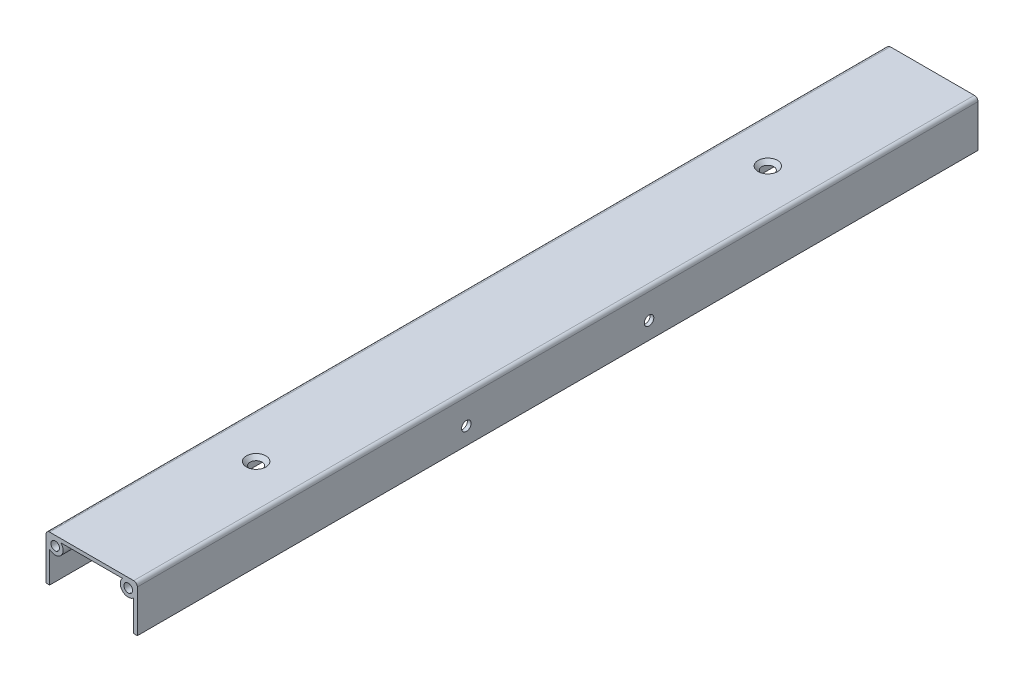
ISO-10303-21;
HEADER;
FILE_DESCRIPTION(('STEP AP214'),'2;1');
FILE_NAME('part.step','',(''),(''),'','','');
FILE_SCHEMA(('AUTOMOTIVE_DESIGN { 1 0 10303 214 1 1 1 1 }'));
ENDSEC;
DATA;
#1=APPLICATION_CONTEXT('core data for automotive mechanical design processes');
#2=APPLICATION_PROTOCOL_DEFINITION('international standard','automotive_design',2000,#1);
#3=PRODUCT_CONTEXT('',#1,'mechanical');
#4=PRODUCT('Part','Part','',(#3));
#5=PRODUCT_RELATED_PRODUCT_CATEGORY('part','',(#4));
#6=PRODUCT_DEFINITION_FORMATION('','',#4);
#7=PRODUCT_DEFINITION_CONTEXT('part definition',#1,'design');
#8=PRODUCT_DEFINITION('design','',#6,#7);
#9=PRODUCT_DEFINITION_SHAPE('','',#8);
#10=(LENGTH_UNIT() NAMED_UNIT(*) SI_UNIT(.MILLI.,.METRE.));
#11=(NAMED_UNIT(*) PLANE_ANGLE_UNIT() SI_UNIT($,.RADIAN.));
#12=(NAMED_UNIT(*) SI_UNIT($,.STERADIAN.) SOLID_ANGLE_UNIT());
#13=UNCERTAINTY_MEASURE_WITH_UNIT(LENGTH_MEASURE(1.E-05),#10,'distance_accuracy_value','');
#14=(GEOMETRIC_REPRESENTATION_CONTEXT(3) GLOBAL_UNCERTAINTY_ASSIGNED_CONTEXT((#13)) GLOBAL_UNIT_ASSIGNED_CONTEXT((#10,
#11,#12)) REPRESENTATION_CONTEXT('',''));
#15=CARTESIAN_POINT('',(0.,0.,0.));
#16=DIRECTION('',(0.,0.,1.));
#17=DIRECTION('',(1.,0.,0.));
#18=AXIS2_PLACEMENT_3D('',#15,#16,#17);
#19=CARTESIAN_POINT('',(0.,0.,292.1));
#20=DIRECTION('',(0.,0.,-1.));
#21=DIRECTION('',(-1.,0.,0.));
#22=AXIS2_PLACEMENT_3D('',#19,#20,#21);
#23=PLANE('',#22);
#24=DIRECTION('',(0.,-1.,0.));
#25=VECTOR('',#24,1.);
#26=CARTESIAN_POINT('',(-31.75,-31.75,292.1));
#27=LINE('',#26,#25);
#28=CARTESIAN_POINT('',(-31.75,29.21,292.1));
#29=VERTEX_POINT('',#28);
#30=CARTESIAN_POINT('',(-31.75,-0.128852466554086,292.1));
#31=VERTEX_POINT('',#30);
#32=EDGE_CURVE('E160',#29,#31,#27,.T.);
#33=ORIENTED_EDGE('',*,*,#32,.T.);
#34=DIRECTION('',(-1.,0.,0.));
#35=VECTOR('',#34,1.);
#36=CARTESIAN_POINT('',(-31.75,-0.128852466554086,292.1));
#37=LINE('',#36,#35);
#38=CARTESIAN_POINT('',(-29.21,-0.128852466554086,292.1));
#39=VERTEX_POINT('',#38);
#40=EDGE_CURVE('E124',#39,#31,#37,.T.);
#41=ORIENTED_EDGE('',*,*,#40,.F.);
#42=DIRECTION('',(0.,-1.,0.));
#43=VECTOR('',#42,1.);
#44=CARTESIAN_POINT('',(-29.21,0.,292.1));
#45=LINE('',#44,#43);
#46=CARTESIAN_POINT('',(-29.21,21.3781223290607,292.1));
#47=VERTEX_POINT('',#46);
#48=EDGE_CURVE('E220',#47,#39,#45,.T.);
#49=ORIENTED_EDGE('',*,*,#48,.F.);
#50=CARTESIAN_POINT('',(-25.4,25.4,292.1));
#51=DIRECTION('',(0.,0.,-1.));
#52=DIRECTION('',(-1.,0.,0.));
#53=AXIS2_PLACEMENT_3D('',#50,#51,#52);
#54=CIRCLE('',#53,5.53999999999999);
#55=CARTESIAN_POINT('',(-21.3781223290607,29.21,292.1));
#56=VERTEX_POINT('',#55);
#57=EDGE_CURVE('E223',#47,#56,#54,.F.);
#58=ORIENTED_EDGE('',*,*,#57,.T.);
#59=DIRECTION('',(-1.,0.,0.));
#60=VECTOR('',#59,1.);
#61=CARTESIAN_POINT('',(0.,29.21,292.1));
#62=LINE('',#61,#60);
#63=CARTESIAN_POINT('',(21.3781223290607,29.21,292.1));
#64=VERTEX_POINT('',#63);
#65=EDGE_CURVE('E241',#64,#56,#62,.T.);
#66=ORIENTED_EDGE('',*,*,#65,.F.);
#67=CARTESIAN_POINT('',(25.4,25.4,292.1));
#68=DIRECTION('',(0.,0.,-1.));
#69=DIRECTION('',(-1.,0.,0.));
#70=AXIS2_PLACEMENT_3D('',#67,#68,#69);
#71=CIRCLE('',#70,5.53999999999999);
#72=CARTESIAN_POINT('',(29.21,21.3781223290607,292.1));
#73=VERTEX_POINT('',#72);
#74=EDGE_CURVE('E224',#64,#73,#71,.F.);
#75=ORIENTED_EDGE('',*,*,#74,.T.);
#76=DIRECTION('',(0.,1.,0.));
#77=VECTOR('',#76,1.);
#78=CARTESIAN_POINT('',(29.21,0.,292.1));
#79=LINE('',#78,#77);
#80=CARTESIAN_POINT('',(29.21,-0.128852466554086,292.1));
#81=VERTEX_POINT('',#80);
#82=EDGE_CURVE('E237',#81,#73,#79,.T.);
#83=ORIENTED_EDGE('',*,*,#82,.F.);
#84=CARTESIAN_POINT('',(31.75,-0.128852466554086,292.1));
#85=VERTEX_POINT('',#84);
#86=EDGE_CURVE('E50',#85,#81,#37,.T.);
#87=ORIENTED_EDGE('',*,*,#86,.F.);
#88=DIRECTION('',(0.,1.,0.));
#89=VECTOR('',#88,1.);
#90=CARTESIAN_POINT('',(31.75,-31.75,292.1));
#91=LINE('',#90,#89);
#92=CARTESIAN_POINT('',(31.75,29.21,292.1));
#93=VERTEX_POINT('',#92);
#94=EDGE_CURVE('E146',#85,#93,#91,.T.);
#95=ORIENTED_EDGE('',*,*,#94,.T.);
#96=CARTESIAN_POINT('',(29.21,29.21,292.1));
#97=DIRECTION('',(0.,0.,-1.));
#98=DIRECTION('',(-1.,0.,0.));
#99=AXIS2_PLACEMENT_3D('',#96,#97,#98);
#100=CIRCLE('',#99,2.54);
#101=CARTESIAN_POINT('',(29.21,31.75,292.1));
#102=VERTEX_POINT('',#101);
#103=EDGE_CURVE('E163',#93,#102,#100,.F.);
#104=ORIENTED_EDGE('',*,*,#103,.T.);
#105=DIRECTION('',(-1.,0.,0.));
#106=VECTOR('',#105,1.);
#107=CARTESIAN_POINT('',(-31.75,31.75,292.1));
#108=LINE('',#107,#106);
#109=CARTESIAN_POINT('',(-29.21,31.75,292.1));
#110=VERTEX_POINT('',#109);
#111=EDGE_CURVE('E149',#102,#110,#108,.T.);
#112=ORIENTED_EDGE('',*,*,#111,.T.);
#113=CARTESIAN_POINT('',(-29.21,29.21,292.1));
#114=DIRECTION('',(0.,0.,-1.));
#115=DIRECTION('',(-1.,0.,0.));
#116=AXIS2_PLACEMENT_3D('',#113,#114,#115);
#117=CIRCLE('',#116,2.54);
#118=EDGE_CURVE('E165',#110,#29,#117,.F.);
#119=ORIENTED_EDGE('',*,*,#118,.T.);
#120=EDGE_LOOP('',(#33,#41,#49,#58,#66,#75,#83,#87,#95,#104,#112,#119));
#121=FACE_BOUND('',#120,.T.);
#122=CARTESIAN_POINT('',(-25.4,25.4,292.1));
#123=DIRECTION('',(0.,0.,1.));
#124=DIRECTION('',(1.,0.,0.));
#125=AXIS2_PLACEMENT_3D('',#122,#123,#124);
#126=CIRCLE('',#125,2.99999999999999);
#127=CARTESIAN_POINT('',(-22.4,25.4,292.1));
#128=VERTEX_POINT('',#127);
#129=EDGE_CURVE('E196',#128,#128,#126,.T.);
#130=ORIENTED_EDGE('',*,*,#129,.F.);
#131=EDGE_LOOP('',(#130));
#132=FACE_BOUND('',#131,.T.);
#133=CARTESIAN_POINT('',(25.4,25.4,292.1));
#134=DIRECTION('',(0.,0.,1.));
#135=DIRECTION('',(-1.,0.,0.));
#136=AXIS2_PLACEMENT_3D('',#133,#134,#135);
#137=CIRCLE('',#136,2.99999999999999);
#138=CARTESIAN_POINT('',(22.4,25.4,292.1));
#139=VERTEX_POINT('',#138);
#140=EDGE_CURVE('E203',#139,#139,#137,.T.);
#141=ORIENTED_EDGE('',*,*,#140,.F.);
#142=EDGE_LOOP('',(#141));
#143=FACE_BOUND('',#142,.T.);
#144=ADVANCED_FACE('F34',(#121,#132,#143),#23,.F.);
#145=CARTESIAN_POINT('',(0.,0.,-292.1));
#146=DIRECTION('',(0.,0.,-1.));
#147=DIRECTION('',(-1.,0.,0.));
#148=AXIS2_PLACEMENT_3D('',#145,#146,#147);
#149=PLANE('',#148);
#150=DIRECTION('',(-1.,0.,0.));
#151=VECTOR('',#150,1.);
#152=CARTESIAN_POINT('',(-31.75,-0.128852466554086,-292.1));
#153=LINE('',#152,#151);
#154=CARTESIAN_POINT('',(-29.21,-0.128852466554086,-292.1));
#155=VERTEX_POINT('',#154);
#156=CARTESIAN_POINT('',(-31.75,-0.128852466554086,-292.1));
#157=VERTEX_POINT('',#156);
#158=EDGE_CURVE('E57',#155,#157,#153,.T.);
#159=ORIENTED_EDGE('',*,*,#158,.T.);
#160=DIRECTION('',(0.,-1.,0.));
#161=VECTOR('',#160,1.);
#162=CARTESIAN_POINT('',(-31.75,-31.75,-292.1));
#163=LINE('',#162,#161);
#164=CARTESIAN_POINT('',(-31.75,29.21,-292.1));
#165=VERTEX_POINT('',#164);
#166=EDGE_CURVE('E137',#165,#157,#163,.T.);
#167=ORIENTED_EDGE('',*,*,#166,.F.);
#168=CARTESIAN_POINT('',(-29.21,29.21,-292.1));
#169=DIRECTION('',(0.,0.,-1.));
#170=DIRECTION('',(-1.,0.,0.));
#171=AXIS2_PLACEMENT_3D('',#168,#169,#170);
#172=CIRCLE('',#171,2.54);
#173=CARTESIAN_POINT('',(-29.21,31.75,-292.1));
#174=VERTEX_POINT('',#173);
#175=EDGE_CURVE('E159',#165,#174,#172,.T.);
#176=ORIENTED_EDGE('',*,*,#175,.T.);
#177=DIRECTION('',(-1.,0.,0.));
#178=VECTOR('',#177,1.);
#179=CARTESIAN_POINT('',(-31.75,31.75,-292.1));
#180=LINE('',#179,#178);
#181=CARTESIAN_POINT('',(29.21,31.75,-292.1));
#182=VERTEX_POINT('',#181);
#183=EDGE_CURVE('E147',#182,#174,#180,.T.);
#184=ORIENTED_EDGE('',*,*,#183,.F.);
#185=CARTESIAN_POINT('',(29.21,29.21,-292.1));
#186=DIRECTION('',(0.,0.,-1.));
#187=DIRECTION('',(-1.,0.,0.));
#188=AXIS2_PLACEMENT_3D('',#185,#186,#187);
#189=CIRCLE('',#188,2.54);
#190=CARTESIAN_POINT('',(31.75,29.21,-292.1));
#191=VERTEX_POINT('',#190);
#192=EDGE_CURVE('E156',#182,#191,#189,.T.);
#193=ORIENTED_EDGE('',*,*,#192,.T.);
#194=DIRECTION('',(0.,1.,0.));
#195=VECTOR('',#194,1.);
#196=CARTESIAN_POINT('',(31.75,-31.75,-292.1));
#197=LINE('',#196,#195);
#198=CARTESIAN_POINT('',(31.75,-0.128852466554086,-292.1));
#199=VERTEX_POINT('',#198);
#200=EDGE_CURVE('E152',#199,#191,#197,.T.);
#201=ORIENTED_EDGE('',*,*,#200,.F.);
#202=CARTESIAN_POINT('',(29.21,-0.128852466554086,-292.1));
#203=VERTEX_POINT('',#202);
#204=EDGE_CURVE('E130',#199,#203,#153,.T.);
#205=ORIENTED_EDGE('',*,*,#204,.T.);
#206=DIRECTION('',(0.,1.,0.));
#207=VECTOR('',#206,1.);
#208=CARTESIAN_POINT('',(29.21,0.,-292.1));
#209=LINE('',#208,#207);
#210=CARTESIAN_POINT('',(29.21,21.3781223290607,-292.1));
#211=VERTEX_POINT('',#210);
#212=EDGE_CURVE('E227',#203,#211,#209,.T.);
#213=ORIENTED_EDGE('',*,*,#212,.T.);
#214=CARTESIAN_POINT('',(25.4,25.4,-292.1));
#215=DIRECTION('',(0.,0.,-1.));
#216=DIRECTION('',(-1.,0.,0.));
#217=AXIS2_PLACEMENT_3D('',#214,#215,#216);
#218=CIRCLE('',#217,5.53999999999999);
#219=CARTESIAN_POINT('',(21.3781223290607,29.21,-292.1));
#220=VERTEX_POINT('',#219);
#221=EDGE_CURVE('E228',#220,#211,#218,.F.);
#222=ORIENTED_EDGE('',*,*,#221,.F.);
#223=DIRECTION('',(-1.,0.,0.));
#224=VECTOR('',#223,1.);
#225=CARTESIAN_POINT('',(0.,29.21,-292.1));
#226=LINE('',#225,#224);
#227=CARTESIAN_POINT('',(-21.3781223290607,29.21,-292.1));
#228=VERTEX_POINT('',#227);
#229=EDGE_CURVE('E233',#220,#228,#226,.T.);
#230=ORIENTED_EDGE('',*,*,#229,.T.);
#231=CARTESIAN_POINT('',(-25.4,25.4,-292.1));
#232=DIRECTION('',(0.,0.,-1.));
#233=DIRECTION('',(-1.,0.,0.));
#234=AXIS2_PLACEMENT_3D('',#231,#232,#233);
#235=CIRCLE('',#234,5.53999999999999);
#236=CARTESIAN_POINT('',(-29.21,21.3781223290607,-292.1));
#237=VERTEX_POINT('',#236);
#238=EDGE_CURVE('E221',#237,#228,#235,.F.);
#239=ORIENTED_EDGE('',*,*,#238,.F.);
#240=DIRECTION('',(0.,-1.,0.));
#241=VECTOR('',#240,1.);
#242=CARTESIAN_POINT('',(-29.21,0.,-292.1));
#243=LINE('',#242,#241);
#244=EDGE_CURVE('E140',#237,#155,#243,.T.);
#245=ORIENTED_EDGE('',*,*,#244,.T.);
#246=EDGE_LOOP('',(#159,#167,#176,#184,#193,#201,#205,#213,#222,#230,#239,#245));
#247=FACE_BOUND('',#246,.T.);
#248=CARTESIAN_POINT('',(-25.4,25.4,-292.1));
#249=DIRECTION('',(0.,0.,1.));
#250=DIRECTION('',(1.,0.,0.));
#251=AXIS2_PLACEMENT_3D('',#248,#249,#250);
#252=CIRCLE('',#251,2.99999999999999);
#253=CARTESIAN_POINT('',(-22.4,25.4,-292.1));
#254=VERTEX_POINT('',#253);
#255=EDGE_CURVE('E198',#254,#254,#252,.T.);
#256=ORIENTED_EDGE('',*,*,#255,.T.);
#257=EDGE_LOOP('',(#256));
#258=FACE_BOUND('',#257,.T.);
#259=CARTESIAN_POINT('',(25.4,25.4,-292.1));
#260=DIRECTION('',(0.,0.,1.));
#261=DIRECTION('',(-1.,0.,0.));
#262=AXIS2_PLACEMENT_3D('',#259,#260,#261);
#263=CIRCLE('',#262,2.99999999999999);
#264=CARTESIAN_POINT('',(22.4,25.4,-292.1));
#265=VERTEX_POINT('',#264);
#266=EDGE_CURVE('E205',#265,#265,#263,.T.);
#267=ORIENTED_EDGE('',*,*,#266,.T.);
#268=EDGE_LOOP('',(#267));
#269=FACE_BOUND('',#268,.T.);
#270=ADVANCED_FACE('F135',(#247,#258,#269),#149,.T.);
#271=CARTESIAN_POINT('',(31.75,-31.75,292.1));
#272=DIRECTION('',(-1.,0.,0.));
#273=DIRECTION('',(0.,0.,1.));
#274=AXIS2_PLACEMENT_3D('',#271,#272,#273);
#275=PLANE('',#274);
#276=CARTESIAN_POINT('',(31.75,11.8118493314459,-63.5));
#277=DIRECTION('',(1.,0.,0.));
#278=DIRECTION('',(0.,0.,-1.));
#279=AXIS2_PLACEMENT_3D('',#276,#277,#278);
#280=CIRCLE('',#279,3.29999999999999);
#281=CARTESIAN_POINT('',(31.75,11.8118493314459,-66.8));
#282=VERTEX_POINT('',#281);
#283=EDGE_CURVE('E266',#282,#282,#280,.T.);
#284=ORIENTED_EDGE('',*,*,#283,.F.);
#285=EDGE_LOOP('',(#284));
#286=FACE_BOUND('',#285,.T.);
#287=CARTESIAN_POINT('',(31.75,11.8118493314459,63.5));
#288=DIRECTION('',(1.,0.,0.));
#289=DIRECTION('',(0.,0.,-1.));
#290=AXIS2_PLACEMENT_3D('',#287,#288,#289);
#291=CIRCLE('',#290,3.29999999999999);
#292=CARTESIAN_POINT('',(31.75,11.8118493314459,60.2));
#293=VERTEX_POINT('',#292);
#294=EDGE_CURVE('E260',#293,#293,#291,.T.);
#295=ORIENTED_EDGE('',*,*,#294,.F.);
#296=EDGE_LOOP('',(#295));
#297=FACE_BOUND('',#296,.T.);
#298=ORIENTED_EDGE('',*,*,#94,.F.);
#299=DIRECTION('',(0.,0.,-1.));
#300=VECTOR('',#299,1.);
#301=CARTESIAN_POINT('',(31.75,-0.128852466554086,292.1));
#302=LINE('',#301,#300);
#303=EDGE_CURVE('E195',#85,#199,#302,.T.);
#304=ORIENTED_EDGE('',*,*,#303,.T.);
#305=ORIENTED_EDGE('',*,*,#200,.T.);
#306=DIRECTION('',(0.,0.,-1.));
#307=VECTOR('',#306,1.);
#308=CARTESIAN_POINT('',(31.75,29.21,292.1));
#309=LINE('',#308,#307);
#310=EDGE_CURVE('E167',#191,#93,#309,.F.);
#311=ORIENTED_EDGE('',*,*,#310,.T.);
#312=EDGE_LOOP('',(#298,#304,#305,#311));
#313=FACE_BOUND('',#312,.T.);
#314=ADVANCED_FACE('F193',(#286,#297,#313),#275,.F.);
#315=CARTESIAN_POINT('',(-31.75,31.75,292.1));
#316=DIRECTION('',(0.,-1.,0.));
#317=DIRECTION('',(0.,0.,-1.));
#318=AXIS2_PLACEMENT_3D('',#315,#316,#317);
#319=PLANE('',#318);
#320=CARTESIAN_POINT('',(0.,31.75,-177.8));
#321=DIRECTION('',(0.,1.,0.));
#322=DIRECTION('',(0.,0.,1.));
#323=AXIS2_PLACEMENT_3D('',#320,#321,#322);
#324=CIRCLE('',#323,6.75);
#325=CARTESIAN_POINT('',(0.,31.75,-171.05));
#326=VERTEX_POINT('',#325);
#327=EDGE_CURVE('E254',#326,#326,#324,.T.);
#328=ORIENTED_EDGE('',*,*,#327,.F.);
#329=EDGE_LOOP('',(#328));
#330=FACE_BOUND('',#329,.T.);
#331=CARTESIAN_POINT('',(0.,31.75,177.8));
#332=DIRECTION('',(0.,1.,0.));
#333=DIRECTION('',(0.,0.,1.));
#334=AXIS2_PLACEMENT_3D('',#331,#332,#333);
#335=CIRCLE('',#334,6.75);
#336=CARTESIAN_POINT('',(0.,31.75,184.55));
#337=VERTEX_POINT('',#336);
#338=EDGE_CURVE('E251',#337,#337,#335,.T.);
#339=ORIENTED_EDGE('',*,*,#338,.F.);
#340=EDGE_LOOP('',(#339));
#341=FACE_BOUND('',#340,.T.);
#342=ORIENTED_EDGE('',*,*,#183,.T.);
#343=DIRECTION('',(0.,0.,-1.));
#344=VECTOR('',#343,1.);
#345=CARTESIAN_POINT('',(-29.21,31.75,292.1));
#346=LINE('',#345,#344);
#347=EDGE_CURVE('E43',#174,#110,#346,.F.);
#348=ORIENTED_EDGE('',*,*,#347,.T.);
#349=ORIENTED_EDGE('',*,*,#111,.F.);
#350=DIRECTION('',(0.,0.,-1.));
#351=VECTOR('',#350,1.);
#352=CARTESIAN_POINT('',(29.21,31.75,292.1));
#353=LINE('',#352,#351);
#354=EDGE_CURVE('E170',#102,#182,#353,.T.);
#355=ORIENTED_EDGE('',*,*,#354,.T.);
#356=EDGE_LOOP('',(#342,#348,#349,#355));
#357=FACE_BOUND('',#356,.T.);
#358=ADVANCED_FACE('F177',(#330,#341,#357),#319,.F.);
#359=CARTESIAN_POINT('',(-31.75,-31.75,292.1));
#360=DIRECTION('',(1.,0.,0.));
#361=DIRECTION('',(0.,0.,-1.));
#362=AXIS2_PLACEMENT_3D('',#359,#360,#361);
#363=PLANE('',#362);
#364=ORIENTED_EDGE('',*,*,#166,.T.);
#365=DIRECTION('',(0.,0.,1.));
#366=VECTOR('',#365,1.);
#367=CARTESIAN_POINT('',(-31.75,-0.128852466554086,-292.1));
#368=LINE('',#367,#366);
#369=EDGE_CURVE('E121',#157,#31,#368,.T.);
#370=ORIENTED_EDGE('',*,*,#369,.T.);
#371=ORIENTED_EDGE('',*,*,#32,.F.);
#372=DIRECTION('',(0.,0.,-1.));
#373=VECTOR('',#372,1.);
#374=CARTESIAN_POINT('',(-31.75,29.21,292.1));
#375=LINE('',#374,#373);
#376=EDGE_CURVE('E145',#29,#165,#375,.T.);
#377=ORIENTED_EDGE('',*,*,#376,.T.);
#378=EDGE_LOOP('',(#364,#370,#371,#377));
#379=FACE_BOUND('',#378,.T.);
#380=ADVANCED_FACE('F143',(#379),#363,.F.);
#381=CARTESIAN_POINT('',(-25.4,25.4,292.1));
#382=DIRECTION('',(0.,0.,-1.));
#383=DIRECTION('',(-1.,0.,0.));
#384=AXIS2_PLACEMENT_3D('',#381,#382,#383);
#385=CYLINDRICAL_SURFACE('',#384,2.99999999999999);
#386=ORIENTED_EDGE('',*,*,#129,.T.);
#387=EDGE_LOOP('',(#386));
#388=FACE_BOUND('',#387,.T.);
#389=ORIENTED_EDGE('',*,*,#255,.F.);
#390=EDGE_LOOP('',(#389));
#391=FACE_BOUND('',#390,.T.);
#392=ADVANCED_FACE('F317',(#388,#391),#385,.F.);
#393=CARTESIAN_POINT('',(25.4,25.4,292.1));
#394=DIRECTION('',(0.,0.,-1.));
#395=DIRECTION('',(-1.,0.,0.));
#396=AXIS2_PLACEMENT_3D('',#393,#394,#395);
#397=CYLINDRICAL_SURFACE('',#396,2.99999999999999);
#398=ORIENTED_EDGE('',*,*,#140,.T.);
#399=EDGE_LOOP('',(#398));
#400=FACE_BOUND('',#399,.T.);
#401=ORIENTED_EDGE('',*,*,#266,.F.);
#402=EDGE_LOOP('',(#401));
#403=FACE_BOUND('',#402,.T.);
#404=ADVANCED_FACE('F325',(#400,#403),#397,.F.);
#405=CARTESIAN_POINT('',(-29.21,29.21,292.1));
#406=DIRECTION('',(0.,0.,-1.));
#407=DIRECTION('',(-1.,0.,0.));
#408=AXIS2_PLACEMENT_3D('',#405,#406,#407);
#409=CYLINDRICAL_SURFACE('',#408,2.54);
#410=ORIENTED_EDGE('',*,*,#118,.F.);
#411=ORIENTED_EDGE('',*,*,#347,.F.);
#412=ORIENTED_EDGE('',*,*,#175,.F.);
#413=ORIENTED_EDGE('',*,*,#376,.F.);
#414=EDGE_LOOP('',(#410,#411,#412,#413));
#415=FACE_BOUND('',#414,.T.);
#416=ADVANCED_FACE('F186',(#415),#409,.T.);
#417=CARTESIAN_POINT('',(29.21,29.21,292.1));
#418=DIRECTION('',(0.,0.,-1.));
#419=DIRECTION('',(-1.,0.,0.));
#420=AXIS2_PLACEMENT_3D('',#417,#418,#419);
#421=CYLINDRICAL_SURFACE('',#420,2.54);
#422=ORIENTED_EDGE('',*,*,#103,.F.);
#423=ORIENTED_EDGE('',*,*,#310,.F.);
#424=ORIENTED_EDGE('',*,*,#192,.F.);
#425=ORIENTED_EDGE('',*,*,#354,.F.);
#426=EDGE_LOOP('',(#422,#423,#424,#425));
#427=FACE_BOUND('',#426,.T.);
#428=ADVANCED_FACE('F36',(#427),#421,.T.);
#429=CARTESIAN_POINT('',(29.21,-31.75,292.1));
#430=DIRECTION('',(-1.,0.,0.));
#431=DIRECTION('',(0.,0.,1.));
#432=AXIS2_PLACEMENT_3D('',#429,#430,#431);
#433=PLANE('',#432);
#434=CARTESIAN_POINT('',(29.21,11.8118493314459,-63.5));
#435=DIRECTION('',(-1.,0.,0.));
#436=DIRECTION('',(0.,0.,1.));
#437=AXIS2_PLACEMENT_3D('',#434,#435,#436);
#438=CIRCLE('',#437,3.29999999999999);
#439=CARTESIAN_POINT('',(29.21,11.8118493314459,-60.2));
#440=VERTEX_POINT('',#439);
#441=EDGE_CURVE('E263',#440,#440,#438,.T.);
#442=ORIENTED_EDGE('',*,*,#441,.F.);
#443=EDGE_LOOP('',(#442));
#444=FACE_BOUND('',#443,.T.);
#445=CARTESIAN_POINT('',(29.21,11.8118493314459,63.5));
#446=DIRECTION('',(-1.,0.,0.));
#447=DIRECTION('',(0.,0.,1.));
#448=AXIS2_PLACEMENT_3D('',#445,#446,#447);
#449=CIRCLE('',#448,3.29999999999999);
#450=CARTESIAN_POINT('',(29.21,11.8118493314459,66.8));
#451=VERTEX_POINT('',#450);
#452=EDGE_CURVE('E257',#451,#451,#449,.T.);
#453=ORIENTED_EDGE('',*,*,#452,.F.);
#454=EDGE_LOOP('',(#453));
#455=FACE_BOUND('',#454,.T.);
#456=DIRECTION('',(0.,0.,-1.));
#457=VECTOR('',#456,1.);
#458=CARTESIAN_POINT('',(29.21,-0.128852466554086,292.1));
#459=LINE('',#458,#457);
#460=EDGE_CURVE('E129',#81,#203,#459,.T.);
#461=ORIENTED_EDGE('',*,*,#460,.F.);
#462=ORIENTED_EDGE('',*,*,#82,.T.);
#463=DIRECTION('',(0.,0.,-1.));
#464=VECTOR('',#463,1.);
#465=CARTESIAN_POINT('',(29.21,21.3781223290607,292.1));
#466=LINE('',#465,#464);
#467=EDGE_CURVE('E217',#73,#211,#466,.T.);
#468=ORIENTED_EDGE('',*,*,#467,.T.);
#469=ORIENTED_EDGE('',*,*,#212,.F.);
#470=EDGE_LOOP('',(#461,#462,#468,#469));
#471=FACE_BOUND('',#470,.T.);
#472=ADVANCED_FACE('F285',(#444,#455,#471),#433,.T.);
#473=CARTESIAN_POINT('',(-31.75,29.21,292.1));
#474=DIRECTION('',(0.,-1.,0.));
#475=DIRECTION('',(0.,0.,-1.));
#476=AXIS2_PLACEMENT_3D('',#473,#474,#475);
#477=PLANE('',#476);
#478=CARTESIAN_POINT('',(0.,29.21,-177.8));
#479=DIRECTION('',(0.,-1.,0.));
#480=DIRECTION('',(0.,0.,-1.));
#481=AXIS2_PLACEMENT_3D('',#478,#479,#480);
#482=CIRCLE('',#481,4.21);
#483=CARTESIAN_POINT('',(0.,29.21,-182.01));
#484=VERTEX_POINT('',#483);
#485=EDGE_CURVE('E38',#484,#484,#482,.T.);
#486=ORIENTED_EDGE('',*,*,#485,.F.);
#487=EDGE_LOOP('',(#486));
#488=FACE_BOUND('',#487,.T.);
#489=CARTESIAN_POINT('',(0.,29.21,177.8));
#490=DIRECTION('',(0.,-1.,0.));
#491=DIRECTION('',(0.,0.,-1.));
#492=AXIS2_PLACEMENT_3D('',#489,#490,#491);
#493=CIRCLE('',#492,4.21);
#494=CARTESIAN_POINT('',(0.,29.21,173.59));
#495=VERTEX_POINT('',#494);
#496=EDGE_CURVE('E247',#495,#495,#493,.T.);
#497=ORIENTED_EDGE('',*,*,#496,.F.);
#498=EDGE_LOOP('',(#497));
#499=FACE_BOUND('',#498,.T.);
#500=DIRECTION('',(0.,0.,-1.));
#501=VECTOR('',#500,1.);
#502=CARTESIAN_POINT('',(-21.3781223290607,29.21,292.1));
#503=LINE('',#502,#501);
#504=EDGE_CURVE('E208',#56,#228,#503,.T.);
#505=ORIENTED_EDGE('',*,*,#504,.T.);
#506=ORIENTED_EDGE('',*,*,#229,.F.);
#507=DIRECTION('',(0.,0.,-1.));
#508=VECTOR('',#507,1.);
#509=CARTESIAN_POINT('',(21.3781223290607,29.21,292.1));
#510=LINE('',#509,#508);
#511=EDGE_CURVE('E215',#64,#220,#510,.T.);
#512=ORIENTED_EDGE('',*,*,#511,.F.);
#513=ORIENTED_EDGE('',*,*,#65,.T.);
#514=EDGE_LOOP('',(#505,#506,#512,#513));
#515=FACE_BOUND('',#514,.T.);
#516=ADVANCED_FACE('F288',(#488,#499,#515),#477,.T.);
#517=CARTESIAN_POINT('',(-29.21,-31.75,292.1));
#518=DIRECTION('',(1.,0.,0.));
#519=DIRECTION('',(0.,0.,-1.));
#520=AXIS2_PLACEMENT_3D('',#517,#518,#519);
#521=PLANE('',#520);
#522=DIRECTION('',(0.,0.,1.));
#523=VECTOR('',#522,1.);
#524=CARTESIAN_POINT('',(-29.21,-0.128852466554086,292.1));
#525=LINE('',#524,#523);
#526=EDGE_CURVE('E11',#155,#39,#525,.T.);
#527=ORIENTED_EDGE('',*,*,#526,.F.);
#528=ORIENTED_EDGE('',*,*,#244,.F.);
#529=DIRECTION('',(0.,0.,-1.));
#530=VECTOR('',#529,1.);
#531=CARTESIAN_POINT('',(-29.21,21.3781223290607,292.1));
#532=LINE('',#531,#530);
#533=EDGE_CURVE('E213',#47,#237,#532,.T.);
#534=ORIENTED_EDGE('',*,*,#533,.F.);
#535=ORIENTED_EDGE('',*,*,#48,.T.);
#536=EDGE_LOOP('',(#527,#528,#534,#535));
#537=FACE_BOUND('',#536,.T.);
#538=ADVANCED_FACE('F342',(#537),#521,.T.);
#539=CARTESIAN_POINT('',(-25.4,25.4,292.1));
#540=DIRECTION('',(0.,0.,-1.));
#541=DIRECTION('',(-1.,0.,0.));
#542=AXIS2_PLACEMENT_3D('',#539,#540,#541);
#543=CYLINDRICAL_SURFACE('',#542,5.53999999999999);
#544=ORIENTED_EDGE('',*,*,#57,.F.);
#545=ORIENTED_EDGE('',*,*,#533,.T.);
#546=ORIENTED_EDGE('',*,*,#238,.T.);
#547=ORIENTED_EDGE('',*,*,#504,.F.);
#548=EDGE_LOOP('',(#544,#545,#546,#547));
#549=FACE_BOUND('',#548,.T.);
#550=ADVANCED_FACE('F339',(#549),#543,.T.);
#551=CARTESIAN_POINT('',(25.4,25.4,292.1));
#552=DIRECTION('',(0.,0.,-1.));
#553=DIRECTION('',(-1.,0.,0.));
#554=AXIS2_PLACEMENT_3D('',#551,#552,#553);
#555=CYLINDRICAL_SURFACE('',#554,5.53999999999999);
#556=ORIENTED_EDGE('',*,*,#511,.T.);
#557=ORIENTED_EDGE('',*,*,#221,.T.);
#558=ORIENTED_EDGE('',*,*,#467,.F.);
#559=ORIENTED_EDGE('',*,*,#74,.F.);
#560=EDGE_LOOP('',(#556,#557,#558,#559));
#561=FACE_BOUND('',#560,.T.);
#562=ADVANCED_FACE('F297',(#561),#555,.T.);
#563=CARTESIAN_POINT('',(-31.75,-0.128852466554086,-292.1));
#564=DIRECTION('',(0.,1.,0.));
#565=DIRECTION('',(0.,0.,1.));
#566=AXIS2_PLACEMENT_3D('',#563,#564,#565);
#567=PLANE('',#566);
#568=ORIENTED_EDGE('',*,*,#526,.T.);
#569=ORIENTED_EDGE('',*,*,#40,.T.);
#570=ORIENTED_EDGE('',*,*,#369,.F.);
#571=ORIENTED_EDGE('',*,*,#158,.F.);
#572=EDGE_LOOP('',(#568,#569,#570,#571));
#573=FACE_BOUND('',#572,.T.);
#574=ADVANCED_FACE('F122',(#573),#567,.F.);
#575=ORIENTED_EDGE('',*,*,#86,.T.);
#576=ORIENTED_EDGE('',*,*,#460,.T.);
#577=ORIENTED_EDGE('',*,*,#204,.F.);
#578=ORIENTED_EDGE('',*,*,#303,.F.);
#579=EDGE_LOOP('',(#575,#576,#577,#578));
#580=FACE_BOUND('',#579,.T.);
#581=ADVANCED_FACE('F300',(#580),#567,.F.);
#582=CARTESIAN_POINT('',(0.,31.75,177.8));
#583=DIRECTION('',(0.,1.,0.));
#584=DIRECTION('',(0.,0.,1.));
#585=AXIS2_PLACEMENT_3D('',#582,#583,#584);
#586=CONICAL_SURFACE('',#585,6.75,0.785398163397448);
#587=ORIENTED_EDGE('',*,*,#496,.T.);
#588=EDGE_LOOP('',(#587));
#589=FACE_BOUND('',#588,.T.);
#590=ORIENTED_EDGE('',*,*,#338,.T.);
#591=EDGE_LOOP('',(#590));
#592=FACE_BOUND('',#591,.T.);
#593=ADVANCED_FACE('F302',(#589,#592),#586,.F.);
#594=CARTESIAN_POINT('',(0.,31.75,-177.8));
#595=DIRECTION('',(0.,1.,0.));
#596=DIRECTION('',(0.,0.,1.));
#597=AXIS2_PLACEMENT_3D('',#594,#595,#596);
#598=CONICAL_SURFACE('',#597,6.75,0.785398163397448);
#599=ORIENTED_EDGE('',*,*,#485,.T.);
#600=EDGE_LOOP('',(#599));
#601=FACE_BOUND('',#600,.T.);
#602=ORIENTED_EDGE('',*,*,#327,.T.);
#603=EDGE_LOOP('',(#602));
#604=FACE_BOUND('',#603,.T.);
#605=ADVANCED_FACE('F281',(#601,#604),#598,.F.);
#606=CARTESIAN_POINT('',(31.75,11.8118493314459,63.5));
#607=DIRECTION('',(1.,0.,0.));
#608=DIRECTION('',(0.,0.,-1.));
#609=AXIS2_PLACEMENT_3D('',#606,#607,#608);
#610=CYLINDRICAL_SURFACE('',#609,3.29999999999999);
#611=ORIENTED_EDGE('',*,*,#294,.T.);
#612=EDGE_LOOP('',(#611));
#613=FACE_BOUND('',#612,.T.);
#614=ORIENTED_EDGE('',*,*,#452,.T.);
#615=EDGE_LOOP('',(#614));
#616=FACE_BOUND('',#615,.T.);
#617=ADVANCED_FACE('F278',(#613,#616),#610,.F.);
#618=CARTESIAN_POINT('',(31.75,11.8118493314459,-63.5));
#619=DIRECTION('',(1.,0.,0.));
#620=DIRECTION('',(0.,0.,-1.));
#621=AXIS2_PLACEMENT_3D('',#618,#619,#620);
#622=CYLINDRICAL_SURFACE('',#621,3.29999999999999);
#623=ORIENTED_EDGE('',*,*,#283,.T.);
#624=EDGE_LOOP('',(#623));
#625=FACE_BOUND('',#624,.T.);
#626=ORIENTED_EDGE('',*,*,#441,.T.);
#627=EDGE_LOOP('',(#626));
#628=FACE_BOUND('',#627,.T.);
#629=ADVANCED_FACE('F270',(#625,#628),#622,.F.);
#630=CLOSED_SHELL('',(#144,#270,#314,#358,#380,#392,#404,#416,#428,#472,#516,#538,#550,#562,
#574,#581,#593,#605,#617,#629));
#631=MANIFOLD_SOLID_BREP('B2',#630);
#632=ADVANCED_BREP_SHAPE_REPRESENTATION('',(#18,#631),#14);
#633=SHAPE_DEFINITION_REPRESENTATION(#9,#632);
ENDSEC;
END-ISO-10303-21;
